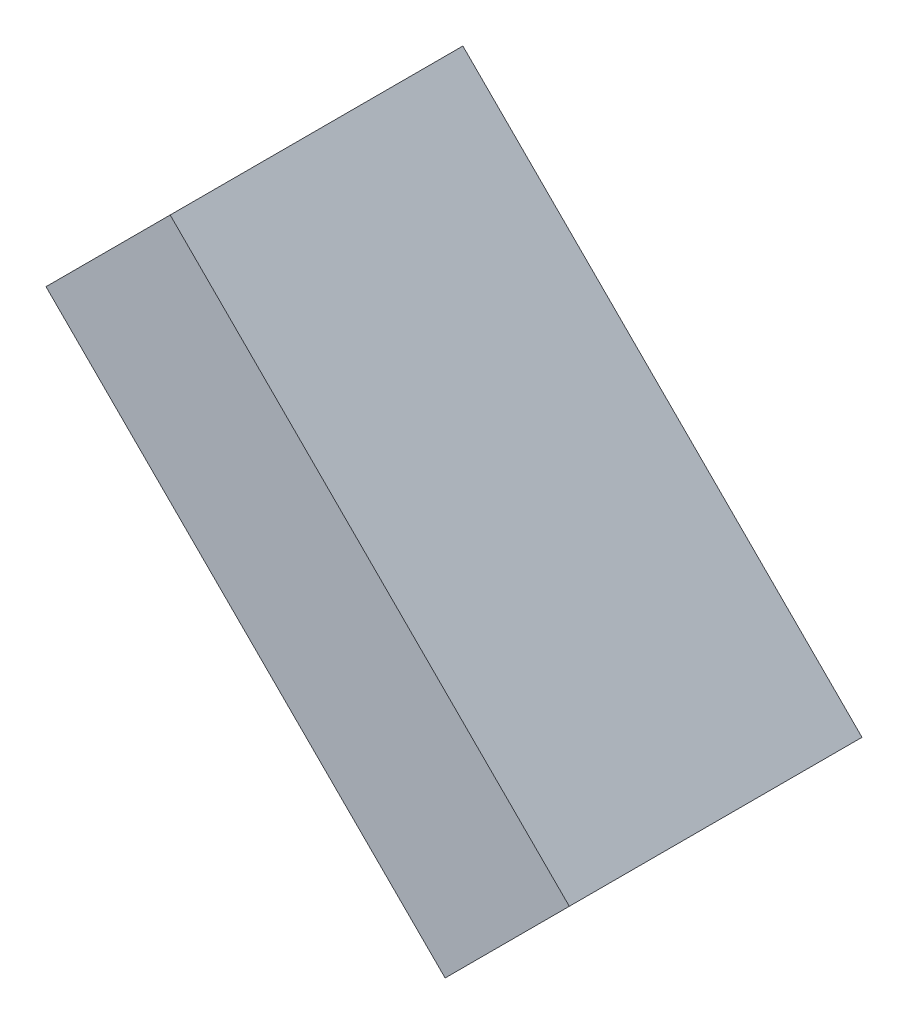
ISO-10303-21;
HEADER;
FILE_DESCRIPTION(('STEP AP214'),'2;1');
FILE_NAME('part.step','',(''),(''),'','','');
FILE_SCHEMA(('AUTOMOTIVE_DESIGN { 1 0 10303 214 1 1 1 1 }'));
ENDSEC;
DATA;
#1=APPLICATION_CONTEXT('core data for automotive mechanical design processes');
#2=APPLICATION_PROTOCOL_DEFINITION('international standard','automotive_design',2000,#1);
#3=PRODUCT_CONTEXT('',#1,'mechanical');
#4=PRODUCT('Part','Part','',(#3));
#5=PRODUCT_RELATED_PRODUCT_CATEGORY('part','',(#4));
#6=PRODUCT_DEFINITION_FORMATION('','',#4);
#7=PRODUCT_DEFINITION_CONTEXT('part definition',#1,'design');
#8=PRODUCT_DEFINITION('design','',#6,#7);
#9=PRODUCT_DEFINITION_SHAPE('','',#8);
#10=(LENGTH_UNIT() NAMED_UNIT(*) SI_UNIT(.MILLI.,.METRE.));
#11=(NAMED_UNIT(*) PLANE_ANGLE_UNIT() SI_UNIT($,.RADIAN.));
#12=(NAMED_UNIT(*) SI_UNIT($,.STERADIAN.) SOLID_ANGLE_UNIT());
#13=UNCERTAINTY_MEASURE_WITH_UNIT(LENGTH_MEASURE(1.E-05),#10,'distance_accuracy_value','');
#14=(GEOMETRIC_REPRESENTATION_CONTEXT(3) GLOBAL_UNCERTAINTY_ASSIGNED_CONTEXT((#13)) GLOBAL_UNIT_ASSIGNED_CONTEXT((#10,
#11,#12)) REPRESENTATION_CONTEXT('',''));
#15=CARTESIAN_POINT('',(0.,0.,0.));
#16=DIRECTION('',(0.,0.,1.));
#17=DIRECTION('',(1.,0.,0.));
#18=AXIS2_PLACEMENT_3D('',#15,#16,#17);
#19=CARTESIAN_POINT('',(-0.328803,0.62578996,0.));
#20=DIRECTION('',(0.707106781186548,0.707106781186548,0.));
#21=DIRECTION('',(0.707106781186548,-0.707106781186548,0.));
#22=AXIS2_PLACEMENT_3D('',#19,#20,#21);
#23=PLANE('',#22);
#24=DIRECTION('',(0.,0.,1.));
#25=VECTOR('',#24,1.);
#26=CARTESIAN_POINT('',(-0.328803,0.62578996,0.));
#27=LINE('',#26,#25);
#28=CARTESIAN_POINT('',(-0.328803,0.62578996,0.));
#29=VERTEX_POINT('',#28);
#30=CARTESIAN_POINT('',(-0.328803,0.62578996,0.70000114));
#31=VERTEX_POINT('',#30);
#32=EDGE_CURVE('E11',#29,#31,#27,.T.);
#33=ORIENTED_EDGE('',*,*,#32,.T.);
#34=DIRECTION('',(0.707106781186548,-0.707106781186548,0.));
#35=VECTOR('',#34,1.);
#36=CARTESIAN_POINT('',(-0.328803,0.62578996,0.70000114));
#37=LINE('',#36,#35);
#38=CARTESIAN_POINT('',(0.62578996,-0.328803,0.70000114));
#39=VERTEX_POINT('',#38);
#40=EDGE_CURVE('E23',#31,#39,#37,.T.);
#41=ORIENTED_EDGE('',*,*,#40,.T.);
#42=DIRECTION('',(0.,0.,1.));
#43=VECTOR('',#42,1.);
#44=CARTESIAN_POINT('',(0.62578996,-0.328803,0.));
#45=LINE('',#44,#43);
#46=CARTESIAN_POINT('',(0.62578996,-0.328803,0.));
#47=VERTEX_POINT('',#46);
#48=EDGE_CURVE('E84',#47,#39,#45,.T.);
#49=ORIENTED_EDGE('',*,*,#48,.F.);
#50=DIRECTION('',(0.707106781186548,-0.707106781186548,0.));
#51=VECTOR('',#50,1.);
#52=CARTESIAN_POINT('',(-0.328803,0.62578996,0.));
#53=LINE('',#52,#51);
#54=EDGE_CURVE('E82',#29,#47,#53,.T.);
#55=ORIENTED_EDGE('',*,*,#54,.F.);
#56=EDGE_LOOP('',(#33,#41,#49,#55));
#57=FACE_BOUND('',#56,.T.);
#58=ADVANCED_FACE('F16',(#57),#23,.T.);
#59=CARTESIAN_POINT('',(0.62578996,-0.328803,0.));
#60=DIRECTION('',(0.707106781186548,-0.707106781186548,0.));
#61=DIRECTION('',(-0.707106781186548,-0.707106781186548,0.));
#62=AXIS2_PLACEMENT_3D('',#59,#60,#61);
#63=PLANE('',#62);
#64=ORIENTED_EDGE('',*,*,#48,.T.);
#65=DIRECTION('',(-0.707106781186548,-0.707106781186548,0.));
#66=VECTOR('',#65,1.);
#67=CARTESIAN_POINT('',(0.62578996,-0.328803,0.70000114));
#68=LINE('',#67,#66);
#69=CARTESIAN_POINT('',(0.32880554,-0.62578742,0.70000114));
#70=VERTEX_POINT('',#69);
#71=EDGE_CURVE('E80',#39,#70,#68,.T.);
#72=ORIENTED_EDGE('',*,*,#71,.T.);
#73=DIRECTION('',(0.,0.,1.));
#74=VECTOR('',#73,1.);
#75=CARTESIAN_POINT('',(0.32880554,-0.62578742,0.));
#76=LINE('',#75,#74);
#77=CARTESIAN_POINT('',(0.32880554,-0.62578742,0.));
#78=VERTEX_POINT('',#77);
#79=EDGE_CURVE('E78',#78,#70,#76,.T.);
#80=ORIENTED_EDGE('',*,*,#79,.F.);
#81=DIRECTION('',(-0.707106781186548,-0.707106781186548,0.));
#82=VECTOR('',#81,1.);
#83=CARTESIAN_POINT('',(0.62578996,-0.328803,0.));
#84=LINE('',#83,#82);
#85=EDGE_CURVE('E69',#47,#78,#84,.T.);
#86=ORIENTED_EDGE('',*,*,#85,.F.);
#87=EDGE_LOOP('',(#64,#72,#80,#86));
#88=FACE_BOUND('',#87,.T.);
#89=ADVANCED_FACE('F89',(#88),#63,.T.);
#90=CARTESIAN_POINT('',(0.32880554,-0.62578742,0.));
#91=DIRECTION('',(-0.707106781186548,-0.707106781186548,0.));
#92=DIRECTION('',(-0.707106781186548,0.707106781186548,0.));
#93=AXIS2_PLACEMENT_3D('',#90,#91,#92);
#94=PLANE('',#93);
#95=ORIENTED_EDGE('',*,*,#79,.T.);
#96=DIRECTION('',(-0.707106781186548,0.707106781186548,0.));
#97=VECTOR('',#96,1.);
#98=CARTESIAN_POINT('',(0.32880554,-0.62578742,0.70000114));
#99=LINE('',#98,#97);
#100=CARTESIAN_POINT('',(-0.62578742,0.32880554,0.70000114));
#101=VERTEX_POINT('',#100);
#102=EDGE_CURVE('E59',#70,#101,#99,.T.);
#103=ORIENTED_EDGE('',*,*,#102,.T.);
#104=DIRECTION('',(0.,0.,1.));
#105=VECTOR('',#104,1.);
#106=CARTESIAN_POINT('',(-0.62578742,0.32880554,0.));
#107=LINE('',#106,#105);
#108=CARTESIAN_POINT('',(-0.62578742,0.32880554,0.));
#109=VERTEX_POINT('',#108);
#110=EDGE_CURVE('E53',#109,#101,#107,.T.);
#111=ORIENTED_EDGE('',*,*,#110,.F.);
#112=DIRECTION('',(-0.707106781186548,0.707106781186548,0.));
#113=VECTOR('',#112,1.);
#114=CARTESIAN_POINT('',(0.32880554,-0.62578742,0.));
#115=LINE('',#114,#113);
#116=EDGE_CURVE('E57',#78,#109,#115,.T.);
#117=ORIENTED_EDGE('',*,*,#116,.F.);
#118=EDGE_LOOP('',(#95,#103,#111,#117));
#119=FACE_BOUND('',#118,.T.);
#120=ADVANCED_FACE('F56',(#119),#94,.T.);
#121=CARTESIAN_POINT('',(-0.62578742,0.32880554,0.));
#122=DIRECTION('',(-0.707106781186548,0.707106781186548,0.));
#123=DIRECTION('',(0.707106781186548,0.707106781186548,0.));
#124=AXIS2_PLACEMENT_3D('',#121,#122,#123);
#125=PLANE('',#124);
#126=ORIENTED_EDGE('',*,*,#110,.T.);
#127=DIRECTION('',(0.707106781186548,0.707106781186548,0.));
#128=VECTOR('',#127,1.);
#129=CARTESIAN_POINT('',(-0.62578742,0.32880554,0.70000114));
#130=LINE('',#129,#128);
#131=EDGE_CURVE('E70',#101,#31,#130,.T.);
#132=ORIENTED_EDGE('',*,*,#131,.T.);
#133=ORIENTED_EDGE('',*,*,#32,.F.);
#134=DIRECTION('',(0.707106781186548,0.707106781186548,0.));
#135=VECTOR('',#134,1.);
#136=CARTESIAN_POINT('',(-0.62578742,0.32880554,0.));
#137=LINE('',#136,#135);
#138=EDGE_CURVE('E67',#109,#29,#137,.T.);
#139=ORIENTED_EDGE('',*,*,#138,.F.);
#140=EDGE_LOOP('',(#126,#132,#133,#139));
#141=FACE_BOUND('',#140,.T.);
#142=ADVANCED_FACE('F72',(#141),#125,.T.);
#143=CARTESIAN_POINT('',(-0.328803,0.62578996,0.));
#144=DIRECTION('',(0.,0.,1.));
#145=DIRECTION('',(1.,0.,0.));
#146=AXIS2_PLACEMENT_3D('',#143,#144,#145);
#147=PLANE('',#146);
#148=ORIENTED_EDGE('',*,*,#54,.T.);
#149=ORIENTED_EDGE('',*,*,#85,.T.);
#150=ORIENTED_EDGE('',*,*,#116,.T.);
#151=ORIENTED_EDGE('',*,*,#138,.T.);
#152=EDGE_LOOP('',(#148,#149,#150,#151));
#153=FACE_BOUND('',#152,.T.);
#154=ADVANCED_FACE('F66',(#153),#147,.F.);
#155=CARTESIAN_POINT('',(-0.328803,0.62578996,0.70000114));
#156=DIRECTION('',(0.,0.,1.));
#157=DIRECTION('',(1.,0.,0.));
#158=AXIS2_PLACEMENT_3D('',#155,#156,#157);
#159=PLANE('',#158);
#160=ORIENTED_EDGE('',*,*,#131,.F.);
#161=ORIENTED_EDGE('',*,*,#102,.F.);
#162=ORIENTED_EDGE('',*,*,#71,.F.);
#163=ORIENTED_EDGE('',*,*,#40,.F.);
#164=EDGE_LOOP('',(#160,#161,#162,#163));
#165=FACE_BOUND('',#164,.T.);
#166=ADVANCED_FACE('F90',(#165),#159,.T.);
#167=CLOSED_SHELL('',(#58,#89,#120,#142,#154,#166));
#168=MANIFOLD_SOLID_BREP('B1',#167);
#169=ADVANCED_BREP_SHAPE_REPRESENTATION('',(#18,#168),#14);
#170=SHAPE_DEFINITION_REPRESENTATION(#9,#169);
ENDSEC;
END-ISO-10303-21;
